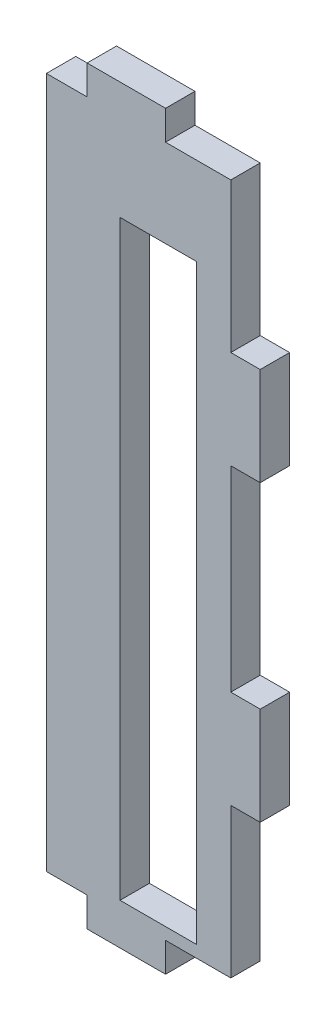
ISO-10303-21;
HEADER;
FILE_DESCRIPTION(('STEP AP214'),'2;1');
FILE_NAME('part.step','',(''),(''),'','','');
FILE_SCHEMA(('AUTOMOTIVE_DESIGN { 1 0 10303 214 1 1 1 1 }'));
ENDSEC;
DATA;
#1=APPLICATION_CONTEXT('core data for automotive mechanical design processes');
#2=APPLICATION_PROTOCOL_DEFINITION('international standard','automotive_design',2000,#1);
#3=PRODUCT_CONTEXT('',#1,'mechanical');
#4=PRODUCT('Part','Part','',(#3));
#5=PRODUCT_RELATED_PRODUCT_CATEGORY('part','',(#4));
#6=PRODUCT_DEFINITION_FORMATION('','',#4);
#7=PRODUCT_DEFINITION_CONTEXT('part definition',#1,'design');
#8=PRODUCT_DEFINITION('design','',#6,#7);
#9=PRODUCT_DEFINITION_SHAPE('','',#8);
#10=(LENGTH_UNIT() NAMED_UNIT(*) SI_UNIT(.MILLI.,.METRE.));
#11=(NAMED_UNIT(*) PLANE_ANGLE_UNIT() SI_UNIT($,.RADIAN.));
#12=(NAMED_UNIT(*) SI_UNIT($,.STERADIAN.) SOLID_ANGLE_UNIT());
#13=UNCERTAINTY_MEASURE_WITH_UNIT(LENGTH_MEASURE(1.E-05),#10,'distance_accuracy_value','');
#14=(GEOMETRIC_REPRESENTATION_CONTEXT(3) GLOBAL_UNCERTAINTY_ASSIGNED_CONTEXT((#13)) GLOBAL_UNIT_ASSIGNED_CONTEXT((#10,
#11,#12)) REPRESENTATION_CONTEXT('',''));
#15=CARTESIAN_POINT('',(0.,0.,0.));
#16=DIRECTION('',(0.,0.,1.));
#17=DIRECTION('',(1.,0.,0.));
#18=AXIS2_PLACEMENT_3D('',#15,#16,#17);
#19=CARTESIAN_POINT('',(0.,44.5,3.));
#20=DIRECTION('',(0.,-1.,0.));
#21=DIRECTION('',(0.,0.,-1.));
#22=AXIS2_PLACEMENT_3D('',#19,#20,#21);
#23=PLANE('',#22);
#24=DIRECTION('',(0.,0.,1.));
#25=VECTOR('',#24,1.);
#26=CARTESIAN_POINT('',(-14.6559207945465,44.4999999999999,0.));
#27=LINE('',#26,#25);
#28=CARTESIAN_POINT('',(-14.6559207945465,44.4999999999999,0.));
#29=VERTEX_POINT('',#28);
#30=CARTESIAN_POINT('',(-14.6559207945465,44.4999999999999,3.));
#31=VERTEX_POINT('',#30);
#32=EDGE_CURVE('E226',#29,#31,#27,.T.);
#33=ORIENTED_EDGE('',*,*,#32,.F.);
#34=DIRECTION('',(-1.,0.,0.));
#35=VECTOR('',#34,1.);
#36=CARTESIAN_POINT('',(0.,44.5,0.));
#37=LINE('',#36,#35);
#38=CARTESIAN_POINT('',(-18.811841589093,44.5,0.));
#39=VERTEX_POINT('',#38);
#40=EDGE_CURVE('E341',#29,#39,#37,.T.);
#41=ORIENTED_EDGE('',*,*,#40,.T.);
#42=DIRECTION('',(0.,0.,1.));
#43=VECTOR('',#42,1.);
#44=CARTESIAN_POINT('',(-18.811841589093,44.5,0.));
#45=LINE('',#44,#43);
#46=CARTESIAN_POINT('',(-18.811841589093,44.5,3.));
#47=VERTEX_POINT('',#46);
#48=EDGE_CURVE('E259',#39,#47,#45,.T.);
#49=ORIENTED_EDGE('',*,*,#48,.T.);
#50=DIRECTION('',(-1.,0.,0.));
#51=VECTOR('',#50,1.);
#52=CARTESIAN_POINT('',(0.,44.5,3.));
#53=LINE('',#52,#51);
#54=EDGE_CURVE('E313',#31,#47,#53,.T.);
#55=ORIENTED_EDGE('',*,*,#54,.F.);
#56=EDGE_LOOP('',(#33,#41,#49,#55));
#57=FACE_BOUND('',#56,.T.);
#58=ADVANCED_FACE('F33',(#57),#23,.F.);
#59=CARTESIAN_POINT('',(0.,-26.,3.));
#60=DIRECTION('',(0.,1.,0.));
#61=DIRECTION('',(0.,0.,1.));
#62=AXIS2_PLACEMENT_3D('',#59,#60,#61);
#63=PLANE('',#62);
#64=DIRECTION('',(0.,0.,1.));
#65=VECTOR('',#64,1.);
#66=CARTESIAN_POINT('',(-6.65592079454647,-25.9999999999998,0.));
#67=LINE('',#66,#65);
#68=CARTESIAN_POINT('',(-6.65592079454647,-25.9999999999998,0.));
#69=VERTEX_POINT('',#68);
#70=CARTESIAN_POINT('',(-6.65592079454647,-25.9999999999998,3.));
#71=VERTEX_POINT('',#70);
#72=EDGE_CURVE('E245',#69,#71,#67,.T.);
#73=ORIENTED_EDGE('',*,*,#72,.F.);
#74=DIRECTION('',(1.,0.,0.));
#75=VECTOR('',#74,1.);
#76=CARTESIAN_POINT('',(0.,-26.,0.));
#77=LINE('',#76,#75);
#78=CARTESIAN_POINT('',(0.,-26.,0.));
#79=VERTEX_POINT('',#78);
#80=EDGE_CURVE('E344',#69,#79,#77,.T.);
#81=ORIENTED_EDGE('',*,*,#80,.T.);
#82=DIRECTION('',(0.,0.,-1.));
#83=VECTOR('',#82,1.);
#84=CARTESIAN_POINT('',(0.,-26.,3.));
#85=LINE('',#84,#83);
#86=CARTESIAN_POINT('',(0.,-26.,3.));
#87=VERTEX_POINT('',#86);
#88=EDGE_CURVE('E351',#87,#79,#85,.T.);
#89=ORIENTED_EDGE('',*,*,#88,.F.);
#90=DIRECTION('',(1.,0.,0.));
#91=VECTOR('',#90,1.);
#92=CARTESIAN_POINT('',(-19.311841589093,-26.,3.));
#93=LINE('',#92,#91);
#94=EDGE_CURVE('E317',#71,#87,#93,.T.);
#95=ORIENTED_EDGE('',*,*,#94,.F.);
#96=EDGE_LOOP('',(#73,#81,#89,#95));
#97=FACE_BOUND('',#96,.T.);
#98=ADVANCED_FACE('F412',(#97),#63,.F.);
#99=CARTESIAN_POINT('',(0.,0.,3.));
#100=DIRECTION('',(0.,0.,1.));
#101=DIRECTION('',(1.,0.,0.));
#102=AXIS2_PLACEMENT_3D('',#99,#100,#101);
#103=PLANE('',#102);
#104=DIRECTION('',(0.,1.,0.));
#105=VECTOR('',#104,1.);
#106=CARTESIAN_POINT('',(-18.811841589093,-26.,3.));
#107=LINE('',#106,#105);
#108=CARTESIAN_POINT('',(-18.811841589093,-26.,3.));
#109=VERTEX_POINT('',#108);
#110=EDGE_CURVE('E247',#109,#47,#107,.T.);
#111=ORIENTED_EDGE('',*,*,#110,.F.);
#112=CARTESIAN_POINT('',(-14.6559207945465,-26.,3.));
#113=VERTEX_POINT('',#112);
#114=EDGE_CURVE('E318',#109,#113,#93,.T.);
#115=ORIENTED_EDGE('',*,*,#114,.T.);
#116=DIRECTION('',(0.,-1.,0.));
#117=VECTOR('',#116,1.);
#118=CARTESIAN_POINT('',(-14.6559207945465,-25.9999999999998,3.));
#119=LINE('',#118,#117);
#120=CARTESIAN_POINT('',(-14.6559207945465,-28.9999999999998,3.));
#121=VERTEX_POINT('',#120);
#122=EDGE_CURVE('E56',#113,#121,#119,.T.);
#123=ORIENTED_EDGE('',*,*,#122,.T.);
#124=DIRECTION('',(1.,0.,0.));
#125=VECTOR('',#124,1.);
#126=CARTESIAN_POINT('',(-6.65592079454647,-28.9999999999998,3.));
#127=LINE('',#126,#125);
#128=CARTESIAN_POINT('',(-6.65592079454647,-28.9999999999998,3.));
#129=VERTEX_POINT('',#128);
#130=EDGE_CURVE('E240',#121,#129,#127,.T.);
#131=ORIENTED_EDGE('',*,*,#130,.T.);
#132=DIRECTION('',(0.,1.,0.));
#133=VECTOR('',#132,1.);
#134=CARTESIAN_POINT('',(-6.65592079454647,-25.9999999999998,3.));
#135=LINE('',#134,#133);
#136=EDGE_CURVE('E233',#129,#71,#135,.T.);
#137=ORIENTED_EDGE('',*,*,#136,.T.);
#138=ORIENTED_EDGE('',*,*,#94,.T.);
#139=DIRECTION('',(0.,1.,0.));
#140=VECTOR('',#139,1.);
#141=CARTESIAN_POINT('',(0.,-24.,3.));
#142=LINE('',#141,#140);
#143=CARTESIAN_POINT('',(0.,-10.75,3.));
#144=VERTEX_POINT('',#143);
#145=EDGE_CURVE('E321',#87,#144,#142,.T.);
#146=ORIENTED_EDGE('',*,*,#145,.T.);
#147=DIRECTION('',(1.,0.,0.));
#148=VECTOR('',#147,1.);
#149=CARTESIAN_POINT('',(3.,-10.75,3.));
#150=LINE('',#149,#148);
#151=CARTESIAN_POINT('',(3.,-10.75,3.));
#152=VERTEX_POINT('',#151);
#153=EDGE_CURVE('E295',#144,#152,#150,.T.);
#154=ORIENTED_EDGE('',*,*,#153,.T.);
#155=DIRECTION('',(0.,1.,0.));
#156=VECTOR('',#155,1.);
#157=CARTESIAN_POINT('',(3.,-10.75,3.));
#158=LINE('',#157,#156);
#159=CARTESIAN_POINT('',(3.,-0.74999999999999,3.));
#160=VERTEX_POINT('',#159);
#161=EDGE_CURVE('E298',#152,#160,#158,.T.);
#162=ORIENTED_EDGE('',*,*,#161,.T.);
#163=DIRECTION('',(-1.,0.,0.));
#164=VECTOR('',#163,1.);
#165=CARTESIAN_POINT('',(3.,-0.74999999999999,3.));
#166=LINE('',#165,#164);
#167=CARTESIAN_POINT('',(0.,-0.749999999999987,3.));
#168=VERTEX_POINT('',#167);
#169=EDGE_CURVE('E301',#160,#168,#166,.T.);
#170=ORIENTED_EDGE('',*,*,#169,.T.);
#171=DIRECTION('',(0.,1.,0.));
#172=VECTOR('',#171,1.);
#173=CARTESIAN_POINT('',(0.,19.25,3.));
#174=LINE('',#173,#172);
#175=CARTESIAN_POINT('',(0.,19.25,3.));
#176=VERTEX_POINT('',#175);
#177=EDGE_CURVE('E303',#168,#176,#174,.T.);
#178=ORIENTED_EDGE('',*,*,#177,.T.);
#179=DIRECTION('',(1.,0.,0.));
#180=VECTOR('',#179,1.);
#181=CARTESIAN_POINT('',(3.,19.25,3.));
#182=LINE('',#181,#180);
#183=CARTESIAN_POINT('',(3.,19.25,3.));
#184=VERTEX_POINT('',#183);
#185=EDGE_CURVE('E305',#176,#184,#182,.T.);
#186=ORIENTED_EDGE('',*,*,#185,.T.);
#187=DIRECTION('',(0.,1.,0.));
#188=VECTOR('',#187,1.);
#189=CARTESIAN_POINT('',(3.,19.25,3.));
#190=LINE('',#189,#188);
#191=CARTESIAN_POINT('',(3.,29.25,3.));
#192=VERTEX_POINT('',#191);
#193=EDGE_CURVE('E307',#184,#192,#190,.T.);
#194=ORIENTED_EDGE('',*,*,#193,.T.);
#195=DIRECTION('',(-1.,0.,0.));
#196=VECTOR('',#195,1.);
#197=CARTESIAN_POINT('',(3.,29.25,3.));
#198=LINE('',#197,#196);
#199=CARTESIAN_POINT('',(0.,29.25,3.));
#200=VERTEX_POINT('',#199);
#201=EDGE_CURVE('E309',#192,#200,#198,.T.);
#202=ORIENTED_EDGE('',*,*,#201,.T.);
#203=DIRECTION('',(0.,1.,0.));
#204=VECTOR('',#203,1.);
#205=CARTESIAN_POINT('',(0.,42.5,3.));
#206=LINE('',#205,#204);
#207=CARTESIAN_POINT('',(0.,44.5,3.));
#208=VERTEX_POINT('',#207);
#209=EDGE_CURVE('E311',#200,#208,#206,.T.);
#210=ORIENTED_EDGE('',*,*,#209,.T.);
#211=CARTESIAN_POINT('',(-6.65592079454648,44.5,3.));
#212=VERTEX_POINT('',#211);
#213=EDGE_CURVE('E314',#208,#212,#53,.T.);
#214=ORIENTED_EDGE('',*,*,#213,.T.);
#215=DIRECTION('',(0.,1.,0.));
#216=VECTOR('',#215,1.);
#217=CARTESIAN_POINT('',(-6.65592079454648,44.4999999999999,3.));
#218=LINE('',#217,#216);
#219=CARTESIAN_POINT('',(-6.65592079454648,47.4999999999999,3.));
#220=VERTEX_POINT('',#219);
#221=EDGE_CURVE('E48',#212,#220,#218,.T.);
#222=ORIENTED_EDGE('',*,*,#221,.T.);
#223=DIRECTION('',(-1.,0.,0.));
#224=VECTOR('',#223,1.);
#225=CARTESIAN_POINT('',(-6.65592079454648,47.4999999999999,3.));
#226=LINE('',#225,#224);
#227=CARTESIAN_POINT('',(-14.6559207945465,47.4999999999999,3.));
#228=VERTEX_POINT('',#227);
#229=EDGE_CURVE('E199',#220,#228,#226,.T.);
#230=ORIENTED_EDGE('',*,*,#229,.T.);
#231=DIRECTION('',(0.,-1.,0.));
#232=VECTOR('',#231,1.);
#233=CARTESIAN_POINT('',(-14.6559207945465,44.4999999999999,3.));
#234=LINE('',#233,#232);
#235=EDGE_CURVE('E217',#228,#31,#234,.T.);
#236=ORIENTED_EDGE('',*,*,#235,.T.);
#237=ORIENTED_EDGE('',*,*,#54,.T.);
#238=EDGE_LOOP('',(#111,#115,#123,#131,#137,#138,#146,#154,#162,#170,#178,#186,#194,#202,#210,
#214,#222,#230,#236,#237));
#239=FACE_BOUND('',#238,.T.);
#240=DIRECTION('',(0.,1.,0.));
#241=VECTOR('',#240,1.);
#242=CARTESIAN_POINT('',(-3.5,-24.785,3.));
#243=LINE('',#242,#241);
#244=CARTESIAN_POINT('',(-3.5,-24.785,3.));
#245=VERTEX_POINT('',#244);
#246=CARTESIAN_POINT('',(-3.5,35.54,3.));
#247=VERTEX_POINT('',#246);
#248=EDGE_CURVE('E266',#245,#247,#243,.T.);
#249=ORIENTED_EDGE('',*,*,#248,.F.);
#250=DIRECTION('',(1.,0.,0.));
#251=VECTOR('',#250,1.);
#252=CARTESIAN_POINT('',(-3.5,-24.785,3.));
#253=LINE('',#252,#251);
#254=CARTESIAN_POINT('',(-11.3,-24.785,3.));
#255=VERTEX_POINT('',#254);
#256=EDGE_CURVE('E264',#255,#245,#253,.T.);
#257=ORIENTED_EDGE('',*,*,#256,.F.);
#258=DIRECTION('',(0.,-1.,0.));
#259=VECTOR('',#258,1.);
#260=CARTESIAN_POINT('',(-11.3,-24.785,3.));
#261=LINE('',#260,#259);
#262=CARTESIAN_POINT('',(-11.3,35.54,3.));
#263=VERTEX_POINT('',#262);
#264=EDGE_CURVE('E272',#263,#255,#261,.T.);
#265=ORIENTED_EDGE('',*,*,#264,.F.);
#266=DIRECTION('',(-1.,0.,0.));
#267=VECTOR('',#266,1.);
#268=CARTESIAN_POINT('',(-3.5,35.54,3.));
#269=LINE('',#268,#267);
#270=EDGE_CURVE('E269',#247,#263,#269,.T.);
#271=ORIENTED_EDGE('',*,*,#270,.F.);
#272=EDGE_LOOP('',(#249,#257,#265,#271));
#273=FACE_BOUND('',#272,.T.);
#274=ADVANCED_FACE('F394',(#239,#273),#103,.T.);
#275=CARTESIAN_POINT('',(0.,0.,0.));
#276=DIRECTION('',(0.,0.,1.));
#277=DIRECTION('',(1.,0.,0.));
#278=AXIS2_PLACEMENT_3D('',#275,#276,#277);
#279=PLANE('',#278);
#280=CARTESIAN_POINT('',(-18.811841589093,-26.,0.));
#281=VERTEX_POINT('',#280);
#282=CARTESIAN_POINT('',(-14.6559207945465,-25.9999999999998,0.));
#283=VERTEX_POINT('',#282);
#284=EDGE_CURVE('E345',#281,#283,#77,.T.);
#285=ORIENTED_EDGE('',*,*,#284,.F.);
#286=DIRECTION('',(0.,1.,0.));
#287=VECTOR('',#286,1.);
#288=CARTESIAN_POINT('',(-18.811841589093,-26.,0.));
#289=LINE('',#288,#287);
#290=EDGE_CURVE('E253',#281,#39,#289,.T.);
#291=ORIENTED_EDGE('',*,*,#290,.T.);
#292=ORIENTED_EDGE('',*,*,#40,.F.);
#293=DIRECTION('',(0.,-1.,0.));
#294=VECTOR('',#293,1.);
#295=CARTESIAN_POINT('',(-14.6559207945465,44.4999999999999,0.));
#296=LINE('',#295,#294);
#297=CARTESIAN_POINT('',(-14.6559207945465,47.4999999999999,0.));
#298=VERTEX_POINT('',#297);
#299=EDGE_CURVE('E202',#298,#29,#296,.T.);
#300=ORIENTED_EDGE('',*,*,#299,.F.);
#301=DIRECTION('',(-1.,0.,0.));
#302=VECTOR('',#301,1.);
#303=CARTESIAN_POINT('',(-6.65592079454648,47.4999999999999,0.));
#304=LINE('',#303,#302);
#305=CARTESIAN_POINT('',(-6.65592079454648,47.4999999999999,0.));
#306=VERTEX_POINT('',#305);
#307=EDGE_CURVE('E197',#306,#298,#304,.T.);
#308=ORIENTED_EDGE('',*,*,#307,.F.);
#309=DIRECTION('',(0.,1.,0.));
#310=VECTOR('',#309,1.);
#311=CARTESIAN_POINT('',(-6.65592079454648,44.4999999999999,0.));
#312=LINE('',#311,#310);
#313=CARTESIAN_POINT('',(-6.65592079454648,44.4999999999999,0.));
#314=VERTEX_POINT('',#313);
#315=EDGE_CURVE('E211',#314,#306,#312,.T.);
#316=ORIENTED_EDGE('',*,*,#315,.F.);
#317=CARTESIAN_POINT('',(0.,44.5,0.));
#318=VERTEX_POINT('',#317);
#319=EDGE_CURVE('E342',#318,#314,#37,.T.);
#320=ORIENTED_EDGE('',*,*,#319,.F.);
#321=DIRECTION('',(0.,1.,0.));
#322=VECTOR('',#321,1.);
#323=CARTESIAN_POINT('',(0.,44.5,0.));
#324=LINE('',#323,#322);
#325=CARTESIAN_POINT('',(0.,29.25,0.));
#326=VERTEX_POINT('',#325);
#327=EDGE_CURVE('E339',#326,#318,#324,.T.);
#328=ORIENTED_EDGE('',*,*,#327,.F.);
#329=DIRECTION('',(-1.,0.,0.));
#330=VECTOR('',#329,1.);
#331=CARTESIAN_POINT('',(3.,29.25,0.));
#332=LINE('',#331,#330);
#333=CARTESIAN_POINT('',(3.,29.25,0.));
#334=VERTEX_POINT('',#333);
#335=EDGE_CURVE('E336',#334,#326,#332,.T.);
#336=ORIENTED_EDGE('',*,*,#335,.F.);
#337=DIRECTION('',(0.,1.,0.));
#338=VECTOR('',#337,1.);
#339=CARTESIAN_POINT('',(3.,19.25,0.));
#340=LINE('',#339,#338);
#341=CARTESIAN_POINT('',(3.,19.25,0.));
#342=VERTEX_POINT('',#341);
#343=EDGE_CURVE('E334',#342,#334,#340,.T.);
#344=ORIENTED_EDGE('',*,*,#343,.F.);
#345=DIRECTION('',(1.,0.,0.));
#346=VECTOR('',#345,1.);
#347=CARTESIAN_POINT('',(3.,19.25,0.));
#348=LINE('',#347,#346);
#349=CARTESIAN_POINT('',(0.,19.25,0.));
#350=VERTEX_POINT('',#349);
#351=EDGE_CURVE('E332',#350,#342,#348,.T.);
#352=ORIENTED_EDGE('',*,*,#351,.F.);
#353=DIRECTION('',(0.,1.,0.));
#354=VECTOR('',#353,1.);
#355=CARTESIAN_POINT('',(0.,19.25,0.));
#356=LINE('',#355,#354);
#357=CARTESIAN_POINT('',(0.,-0.749999999999987,0.));
#358=VERTEX_POINT('',#357);
#359=EDGE_CURVE('E330',#358,#350,#356,.T.);
#360=ORIENTED_EDGE('',*,*,#359,.F.);
#361=DIRECTION('',(-1.,0.,0.));
#362=VECTOR('',#361,1.);
#363=CARTESIAN_POINT('',(3.,-0.74999999999999,0.));
#364=LINE('',#363,#362);
#365=CARTESIAN_POINT('',(3.,-0.74999999999999,0.));
#366=VERTEX_POINT('',#365);
#367=EDGE_CURVE('E328',#366,#358,#364,.T.);
#368=ORIENTED_EDGE('',*,*,#367,.F.);
#369=DIRECTION('',(0.,1.,0.));
#370=VECTOR('',#369,1.);
#371=CARTESIAN_POINT('',(3.,-10.75,0.));
#372=LINE('',#371,#370);
#373=CARTESIAN_POINT('',(3.,-10.75,0.));
#374=VERTEX_POINT('',#373);
#375=EDGE_CURVE('E326',#374,#366,#372,.T.);
#376=ORIENTED_EDGE('',*,*,#375,.F.);
#377=DIRECTION('',(1.,0.,0.));
#378=VECTOR('',#377,1.);
#379=CARTESIAN_POINT('',(3.,-10.75,0.));
#380=LINE('',#379,#378);
#381=CARTESIAN_POINT('',(0.,-10.75,0.));
#382=VERTEX_POINT('',#381);
#383=EDGE_CURVE('E294',#382,#374,#380,.T.);
#384=ORIENTED_EDGE('',*,*,#383,.F.);
#385=DIRECTION('',(0.,1.,0.));
#386=VECTOR('',#385,1.);
#387=CARTESIAN_POINT('',(0.,-10.75,0.));
#388=LINE('',#387,#386);
#389=EDGE_CURVE('E299',#79,#382,#388,.T.);
#390=ORIENTED_EDGE('',*,*,#389,.F.);
#391=ORIENTED_EDGE('',*,*,#80,.F.);
#392=DIRECTION('',(0.,1.,0.));
#393=VECTOR('',#392,1.);
#394=CARTESIAN_POINT('',(-6.65592079454647,-25.9999999999998,0.));
#395=LINE('',#394,#393);
#396=CARTESIAN_POINT('',(-6.65592079454647,-28.9999999999998,0.));
#397=VERTEX_POINT('',#396);
#398=EDGE_CURVE('E236',#397,#69,#395,.T.);
#399=ORIENTED_EDGE('',*,*,#398,.F.);
#400=DIRECTION('',(1.,0.,0.));
#401=VECTOR('',#400,1.);
#402=CARTESIAN_POINT('',(-6.65592079454647,-28.9999999999998,0.));
#403=LINE('',#402,#401);
#404=CARTESIAN_POINT('',(-14.6559207945465,-28.9999999999998,0.));
#405=VERTEX_POINT('',#404);
#406=EDGE_CURVE('E232',#405,#397,#403,.T.);
#407=ORIENTED_EDGE('',*,*,#406,.F.);
#408=DIRECTION('',(0.,-1.,0.));
#409=VECTOR('',#408,1.);
#410=CARTESIAN_POINT('',(-14.6559207945465,-25.9999999999998,0.));
#411=LINE('',#410,#409);
#412=EDGE_CURVE('E229',#283,#405,#411,.T.);
#413=ORIENTED_EDGE('',*,*,#412,.F.);
#414=EDGE_LOOP('',(#285,#291,#292,#300,#308,#316,#320,#328,#336,#344,#352,#360,#368,#376,#384,
#390,#391,#399,#407,#413));
#415=FACE_BOUND('',#414,.T.);
#416=DIRECTION('',(1.,0.,0.));
#417=VECTOR('',#416,1.);
#418=CARTESIAN_POINT('',(-3.5,-24.785,0.));
#419=LINE('',#418,#417);
#420=CARTESIAN_POINT('',(-11.3,-24.785,0.));
#421=VERTEX_POINT('',#420);
#422=CARTESIAN_POINT('',(-3.5,-24.785,0.));
#423=VERTEX_POINT('',#422);
#424=EDGE_CURVE('E262',#421,#423,#419,.T.);
#425=ORIENTED_EDGE('',*,*,#424,.T.);
#426=DIRECTION('',(0.,1.,0.));
#427=VECTOR('',#426,1.);
#428=CARTESIAN_POINT('',(-3.5,-24.785,0.));
#429=LINE('',#428,#427);
#430=CARTESIAN_POINT('',(-3.5,35.54,0.));
#431=VERTEX_POINT('',#430);
#432=EDGE_CURVE('E277',#423,#431,#429,.T.);
#433=ORIENTED_EDGE('',*,*,#432,.T.);
#434=DIRECTION('',(-1.,0.,0.));
#435=VECTOR('',#434,1.);
#436=CARTESIAN_POINT('',(-3.5,35.54,0.));
#437=LINE('',#436,#435);
#438=CARTESIAN_POINT('',(-11.3,35.54,0.));
#439=VERTEX_POINT('',#438);
#440=EDGE_CURVE('E280',#431,#439,#437,.T.);
#441=ORIENTED_EDGE('',*,*,#440,.T.);
#442=DIRECTION('',(0.,-1.,0.));
#443=VECTOR('',#442,1.);
#444=CARTESIAN_POINT('',(-11.3,-24.785,0.));
#445=LINE('',#444,#443);
#446=EDGE_CURVE('E267',#439,#421,#445,.T.);
#447=ORIENTED_EDGE('',*,*,#446,.T.);
#448=EDGE_LOOP('',(#425,#433,#441,#447));
#449=FACE_BOUND('',#448,.T.);
#450=ADVANCED_FACE('F208',(#415,#449),#279,.F.);
#451=CARTESIAN_POINT('',(3.,-10.75,3.));
#452=DIRECTION('',(0.,1.,0.));
#453=DIRECTION('',(0.,0.,1.));
#454=AXIS2_PLACEMENT_3D('',#451,#452,#453);
#455=PLANE('',#454);
#456=ORIENTED_EDGE('',*,*,#383,.T.);
#457=DIRECTION('',(0.,0.,-1.));
#458=VECTOR('',#457,1.);
#459=CARTESIAN_POINT('',(3.,-10.75,3.));
#460=LINE('',#459,#458);
#461=EDGE_CURVE('E11',#152,#374,#460,.T.);
#462=ORIENTED_EDGE('',*,*,#461,.F.);
#463=ORIENTED_EDGE('',*,*,#153,.F.);
#464=DIRECTION('',(0.,0.,-1.));
#465=VECTOR('',#464,1.);
#466=CARTESIAN_POINT('',(0.,-10.75,3.));
#467=LINE('',#466,#465);
#468=EDGE_CURVE('E323',#144,#382,#467,.T.);
#469=ORIENTED_EDGE('',*,*,#468,.T.);
#470=EDGE_LOOP('',(#456,#462,#463,#469));
#471=FACE_BOUND('',#470,.T.);
#472=ADVANCED_FACE('F35',(#471),#455,.F.);
#473=CARTESIAN_POINT('',(3.,-10.75,3.));
#474=DIRECTION('',(-1.,0.,0.));
#475=DIRECTION('',(0.,0.,1.));
#476=AXIS2_PLACEMENT_3D('',#473,#474,#475);
#477=PLANE('',#476);
#478=ORIENTED_EDGE('',*,*,#375,.T.);
#479=DIRECTION('',(0.,0.,-1.));
#480=VECTOR('',#479,1.);
#481=CARTESIAN_POINT('',(3.,-0.74999999999999,3.));
#482=LINE('',#481,#480);
#483=EDGE_CURVE('E41',#160,#366,#482,.T.);
#484=ORIENTED_EDGE('',*,*,#483,.F.);
#485=ORIENTED_EDGE('',*,*,#161,.F.);
#486=ORIENTED_EDGE('',*,*,#461,.T.);
#487=EDGE_LOOP('',(#478,#484,#485,#486));
#488=FACE_BOUND('',#487,.T.);
#489=ADVANCED_FACE('F399',(#488),#477,.F.);
#490=CARTESIAN_POINT('',(3.,-0.74999999999999,3.));
#491=DIRECTION('',(0.,-1.,0.));
#492=DIRECTION('',(1.,0.,0.));
#493=AXIS2_PLACEMENT_3D('',#490,#491,#492);
#494=PLANE('',#493);
#495=ORIENTED_EDGE('',*,*,#367,.T.);
#496=DIRECTION('',(0.,0.,-1.));
#497=VECTOR('',#496,1.);
#498=CARTESIAN_POINT('',(0.,-0.749999999999987,3.));
#499=LINE('',#498,#497);
#500=EDGE_CURVE('E369',#168,#358,#499,.T.);
#501=ORIENTED_EDGE('',*,*,#500,.F.);
#502=ORIENTED_EDGE('',*,*,#169,.F.);
#503=ORIENTED_EDGE('',*,*,#483,.T.);
#504=EDGE_LOOP('',(#495,#501,#502,#503));
#505=FACE_BOUND('',#504,.T.);
#506=ADVANCED_FACE('F376',(#505),#494,.F.);
#507=CARTESIAN_POINT('',(0.,19.25,3.));
#508=DIRECTION('',(-1.,0.,0.));
#509=DIRECTION('',(0.,0.,1.));
#510=AXIS2_PLACEMENT_3D('',#507,#508,#509);
#511=PLANE('',#510);
#512=ORIENTED_EDGE('',*,*,#359,.T.);
#513=DIRECTION('',(0.,0.,-1.));
#514=VECTOR('',#513,1.);
#515=CARTESIAN_POINT('',(0.,19.25,3.));
#516=LINE('',#515,#514);
#517=EDGE_CURVE('E366',#176,#350,#516,.T.);
#518=ORIENTED_EDGE('',*,*,#517,.F.);
#519=ORIENTED_EDGE('',*,*,#177,.F.);
#520=ORIENTED_EDGE('',*,*,#500,.T.);
#521=EDGE_LOOP('',(#512,#518,#519,#520));
#522=FACE_BOUND('',#521,.T.);
#523=ADVANCED_FACE('F385',(#522),#511,.F.);
#524=CARTESIAN_POINT('',(3.,19.25,3.));
#525=DIRECTION('',(0.,1.,0.));
#526=DIRECTION('',(0.,0.,1.));
#527=AXIS2_PLACEMENT_3D('',#524,#525,#526);
#528=PLANE('',#527);
#529=ORIENTED_EDGE('',*,*,#351,.T.);
#530=DIRECTION('',(0.,0.,-1.));
#531=VECTOR('',#530,1.);
#532=CARTESIAN_POINT('',(3.,19.25,3.));
#533=LINE('',#532,#531);
#534=EDGE_CURVE('E363',#184,#342,#533,.T.);
#535=ORIENTED_EDGE('',*,*,#534,.F.);
#536=ORIENTED_EDGE('',*,*,#185,.F.);
#537=ORIENTED_EDGE('',*,*,#517,.T.);
#538=EDGE_LOOP('',(#529,#535,#536,#537));
#539=FACE_BOUND('',#538,.T.);
#540=ADVANCED_FACE('F389',(#539),#528,.F.);
#541=CARTESIAN_POINT('',(3.,19.25,3.));
#542=DIRECTION('',(-1.,0.,0.));
#543=DIRECTION('',(0.,0.,1.));
#544=AXIS2_PLACEMENT_3D('',#541,#542,#543);
#545=PLANE('',#544);
#546=ORIENTED_EDGE('',*,*,#343,.T.);
#547=DIRECTION('',(0.,0.,-1.));
#548=VECTOR('',#547,1.);
#549=CARTESIAN_POINT('',(3.,29.25,3.));
#550=LINE('',#549,#548);
#551=EDGE_CURVE('E360',#192,#334,#550,.T.);
#552=ORIENTED_EDGE('',*,*,#551,.F.);
#553=ORIENTED_EDGE('',*,*,#193,.F.);
#554=ORIENTED_EDGE('',*,*,#534,.T.);
#555=EDGE_LOOP('',(#546,#552,#553,#554));
#556=FACE_BOUND('',#555,.T.);
#557=ADVANCED_FACE('F454',(#556),#545,.F.);
#558=CARTESIAN_POINT('',(3.,29.25,3.));
#559=DIRECTION('',(0.,-1.,0.));
#560=DIRECTION('',(0.,0.,-1.));
#561=AXIS2_PLACEMENT_3D('',#558,#559,#560);
#562=PLANE('',#561);
#563=ORIENTED_EDGE('',*,*,#335,.T.);
#564=DIRECTION('',(0.,0.,-1.));
#565=VECTOR('',#564,1.);
#566=CARTESIAN_POINT('',(0.,29.25,3.));
#567=LINE('',#566,#565);
#568=EDGE_CURVE('E357',#200,#326,#567,.T.);
#569=ORIENTED_EDGE('',*,*,#568,.F.);
#570=ORIENTED_EDGE('',*,*,#201,.F.);
#571=ORIENTED_EDGE('',*,*,#551,.T.);
#572=EDGE_LOOP('',(#563,#569,#570,#571));
#573=FACE_BOUND('',#572,.T.);
#574=ADVANCED_FACE('F444',(#573),#562,.F.);
#575=CARTESIAN_POINT('',(0.,44.5,3.));
#576=DIRECTION('',(-1.,0.,0.));
#577=DIRECTION('',(0.,0.,1.));
#578=AXIS2_PLACEMENT_3D('',#575,#576,#577);
#579=PLANE('',#578);
#580=ORIENTED_EDGE('',*,*,#327,.T.);
#581=DIRECTION('',(0.,0.,-1.));
#582=VECTOR('',#581,1.);
#583=CARTESIAN_POINT('',(0.,44.5,3.));
#584=LINE('',#583,#582);
#585=EDGE_CURVE('E354',#208,#318,#584,.T.);
#586=ORIENTED_EDGE('',*,*,#585,.F.);
#587=ORIENTED_EDGE('',*,*,#209,.F.);
#588=ORIENTED_EDGE('',*,*,#568,.T.);
#589=EDGE_LOOP('',(#580,#586,#587,#588));
#590=FACE_BOUND('',#589,.T.);
#591=ADVANCED_FACE('F446',(#590),#579,.F.);
#592=ORIENTED_EDGE('',*,*,#319,.T.);
#593=DIRECTION('',(0.,0.,1.));
#594=VECTOR('',#593,1.);
#595=CARTESIAN_POINT('',(-6.65592079454648,44.4999999999999,0.));
#596=LINE('',#595,#594);
#597=EDGE_CURVE('E216',#314,#212,#596,.T.);
#598=ORIENTED_EDGE('',*,*,#597,.T.);
#599=ORIENTED_EDGE('',*,*,#213,.F.);
#600=ORIENTED_EDGE('',*,*,#585,.T.);
#601=EDGE_LOOP('',(#592,#598,#599,#600));
#602=FACE_BOUND('',#601,.T.);
#603=ADVANCED_FACE('F439',(#602),#23,.F.);
#604=ORIENTED_EDGE('',*,*,#284,.T.);
#605=DIRECTION('',(0.,0.,1.));
#606=VECTOR('',#605,1.);
#607=CARTESIAN_POINT('',(-14.6559207945465,-25.9999999999998,0.));
#608=LINE('',#607,#606);
#609=EDGE_CURVE('E238',#283,#113,#608,.T.);
#610=ORIENTED_EDGE('',*,*,#609,.T.);
#611=ORIENTED_EDGE('',*,*,#114,.F.);
#612=DIRECTION('',(0.,0.,1.));
#613=VECTOR('',#612,1.);
#614=CARTESIAN_POINT('',(-18.811841589093,-26.,0.));
#615=LINE('',#614,#613);
#616=EDGE_CURVE('E256',#281,#109,#615,.T.);
#617=ORIENTED_EDGE('',*,*,#616,.F.);
#618=EDGE_LOOP('',(#604,#610,#611,#617));
#619=FACE_BOUND('',#618,.T.);
#620=ADVANCED_FACE('F424',(#619),#63,.F.);
#621=CARTESIAN_POINT('',(0.,-10.75,3.));
#622=DIRECTION('',(-1.,0.,0.));
#623=DIRECTION('',(0.,0.,1.));
#624=AXIS2_PLACEMENT_3D('',#621,#622,#623);
#625=PLANE('',#624);
#626=ORIENTED_EDGE('',*,*,#389,.T.);
#627=ORIENTED_EDGE('',*,*,#468,.F.);
#628=ORIENTED_EDGE('',*,*,#145,.F.);
#629=ORIENTED_EDGE('',*,*,#88,.T.);
#630=EDGE_LOOP('',(#626,#627,#628,#629));
#631=FACE_BOUND('',#630,.T.);
#632=ADVANCED_FACE('F408',(#631),#625,.F.);
#633=CARTESIAN_POINT('',(-3.5,-24.785,3.));
#634=DIRECTION('',(0.,1.,0.));
#635=DIRECTION('',(0.,0.,1.));
#636=AXIS2_PLACEMENT_3D('',#633,#634,#635);
#637=PLANE('',#636);
#638=ORIENTED_EDGE('',*,*,#424,.F.);
#639=DIRECTION('',(0.,0.,-1.));
#640=VECTOR('',#639,1.);
#641=CARTESIAN_POINT('',(-11.3,-24.785,3.));
#642=LINE('',#641,#640);
#643=EDGE_CURVE('E274',#255,#421,#642,.T.);
#644=ORIENTED_EDGE('',*,*,#643,.F.);
#645=ORIENTED_EDGE('',*,*,#256,.T.);
#646=DIRECTION('',(0.,0.,-1.));
#647=VECTOR('',#646,1.);
#648=CARTESIAN_POINT('',(-3.5,-24.785,3.));
#649=LINE('',#648,#647);
#650=EDGE_CURVE('E291',#245,#423,#649,.T.);
#651=ORIENTED_EDGE('',*,*,#650,.T.);
#652=EDGE_LOOP('',(#638,#644,#645,#651));
#653=FACE_BOUND('',#652,.T.);
#654=ADVANCED_FACE('F465',(#653),#637,.T.);
#655=CARTESIAN_POINT('',(-3.5,-24.785,3.));
#656=DIRECTION('',(-1.,0.,0.));
#657=DIRECTION('',(0.,0.,1.));
#658=AXIS2_PLACEMENT_3D('',#655,#656,#657);
#659=PLANE('',#658);
#660=ORIENTED_EDGE('',*,*,#432,.F.);
#661=ORIENTED_EDGE('',*,*,#650,.F.);
#662=ORIENTED_EDGE('',*,*,#248,.T.);
#663=DIRECTION('',(0.,0.,-1.));
#664=VECTOR('',#663,1.);
#665=CARTESIAN_POINT('',(-3.5,35.54,3.));
#666=LINE('',#665,#664);
#667=EDGE_CURVE('E289',#247,#431,#666,.T.);
#668=ORIENTED_EDGE('',*,*,#667,.T.);
#669=EDGE_LOOP('',(#660,#661,#662,#668));
#670=FACE_BOUND('',#669,.T.);
#671=ADVANCED_FACE('F472',(#670),#659,.T.);
#672=CARTESIAN_POINT('',(-3.5,35.54,3.));
#673=DIRECTION('',(0.,-1.,0.));
#674=DIRECTION('',(0.,0.,-1.));
#675=AXIS2_PLACEMENT_3D('',#672,#673,#674);
#676=PLANE('',#675);
#677=ORIENTED_EDGE('',*,*,#440,.F.);
#678=ORIENTED_EDGE('',*,*,#667,.F.);
#679=ORIENTED_EDGE('',*,*,#270,.T.);
#680=DIRECTION('',(0.,0.,-1.));
#681=VECTOR('',#680,1.);
#682=CARTESIAN_POINT('',(-11.3,35.54,3.));
#683=LINE('',#682,#681);
#684=EDGE_CURVE('E287',#263,#439,#683,.T.);
#685=ORIENTED_EDGE('',*,*,#684,.T.);
#686=EDGE_LOOP('',(#677,#678,#679,#685));
#687=FACE_BOUND('',#686,.T.);
#688=ADVANCED_FACE('F476',(#687),#676,.T.);
#689=CARTESIAN_POINT('',(-11.3,-24.785,3.));
#690=DIRECTION('',(1.,0.,0.));
#691=DIRECTION('',(0.,0.,-1.));
#692=AXIS2_PLACEMENT_3D('',#689,#690,#691);
#693=PLANE('',#692);
#694=ORIENTED_EDGE('',*,*,#446,.F.);
#695=ORIENTED_EDGE('',*,*,#684,.F.);
#696=ORIENTED_EDGE('',*,*,#264,.T.);
#697=ORIENTED_EDGE('',*,*,#643,.T.);
#698=EDGE_LOOP('',(#694,#695,#696,#697));
#699=FACE_BOUND('',#698,.T.);
#700=ADVANCED_FACE('F480',(#699),#693,.T.);
#701=CARTESIAN_POINT('',(-18.811841589093,-26.,0.));
#702=DIRECTION('',(1.,0.,0.));
#703=DIRECTION('',(0.,0.,-1.));
#704=AXIS2_PLACEMENT_3D('',#701,#702,#703);
#705=PLANE('',#704);
#706=ORIENTED_EDGE('',*,*,#110,.T.);
#707=ORIENTED_EDGE('',*,*,#48,.F.);
#708=ORIENTED_EDGE('',*,*,#290,.F.);
#709=ORIENTED_EDGE('',*,*,#616,.T.);
#710=EDGE_LOOP('',(#706,#707,#708,#709));
#711=FACE_BOUND('',#710,.T.);
#712=ADVANCED_FACE('F429',(#711),#705,.F.);
#713=CARTESIAN_POINT('',(-6.65592079454647,-25.9999999999998,0.));
#714=DIRECTION('',(1.,0.,0.));
#715=DIRECTION('',(0.,0.,-1.));
#716=AXIS2_PLACEMENT_3D('',#713,#714,#715);
#717=PLANE('',#716);
#718=ORIENTED_EDGE('',*,*,#136,.F.);
#719=DIRECTION('',(0.,0.,1.));
#720=VECTOR('',#719,1.);
#721=CARTESIAN_POINT('',(-6.65592079454647,-28.9999999999998,0.));
#722=LINE('',#721,#720);
#723=EDGE_CURVE('E248',#397,#129,#722,.T.);
#724=ORIENTED_EDGE('',*,*,#723,.F.);
#725=ORIENTED_EDGE('',*,*,#398,.T.);
#726=ORIENTED_EDGE('',*,*,#72,.T.);
#727=EDGE_LOOP('',(#718,#724,#725,#726));
#728=FACE_BOUND('',#727,.T.);
#729=ADVANCED_FACE('F415',(#728),#717,.T.);
#730=CARTESIAN_POINT('',(-6.65592079454647,-28.9999999999998,0.));
#731=DIRECTION('',(0.,-1.,0.));
#732=DIRECTION('',(0.,0.,-1.));
#733=AXIS2_PLACEMENT_3D('',#730,#731,#732);
#734=PLANE('',#733);
#735=ORIENTED_EDGE('',*,*,#130,.F.);
#736=DIRECTION('',(0.,0.,1.));
#737=VECTOR('',#736,1.);
#738=CARTESIAN_POINT('',(-14.6559207945465,-28.9999999999998,0.));
#739=LINE('',#738,#737);
#740=EDGE_CURVE('E250',#405,#121,#739,.T.);
#741=ORIENTED_EDGE('',*,*,#740,.F.);
#742=ORIENTED_EDGE('',*,*,#406,.T.);
#743=ORIENTED_EDGE('',*,*,#723,.T.);
#744=EDGE_LOOP('',(#735,#741,#742,#743));
#745=FACE_BOUND('',#744,.T.);
#746=ADVANCED_FACE('F418',(#745),#734,.T.);
#747=CARTESIAN_POINT('',(-14.6559207945465,-25.9999999999998,0.));
#748=DIRECTION('',(-1.,0.,0.));
#749=DIRECTION('',(0.,0.,1.));
#750=AXIS2_PLACEMENT_3D('',#747,#748,#749);
#751=PLANE('',#750);
#752=ORIENTED_EDGE('',*,*,#122,.F.);
#753=ORIENTED_EDGE('',*,*,#609,.F.);
#754=ORIENTED_EDGE('',*,*,#412,.T.);
#755=ORIENTED_EDGE('',*,*,#740,.T.);
#756=EDGE_LOOP('',(#752,#753,#754,#755));
#757=FACE_BOUND('',#756,.T.);
#758=ADVANCED_FACE('F421',(#757),#751,.T.);
#759=CARTESIAN_POINT('',(-6.65592079454648,44.4999999999999,0.));
#760=DIRECTION('',(1.,0.,0.));
#761=DIRECTION('',(0.,1.,0.));
#762=AXIS2_PLACEMENT_3D('',#759,#760,#761);
#763=PLANE('',#762);
#764=ORIENTED_EDGE('',*,*,#221,.F.);
#765=ORIENTED_EDGE('',*,*,#597,.F.);
#766=ORIENTED_EDGE('',*,*,#315,.T.);
#767=DIRECTION('',(0.,0.,1.));
#768=VECTOR('',#767,1.);
#769=CARTESIAN_POINT('',(-6.65592079454648,47.4999999999999,0.));
#770=LINE('',#769,#768);
#771=EDGE_CURVE('E194',#306,#220,#770,.T.);
#772=ORIENTED_EDGE('',*,*,#771,.T.);
#773=EDGE_LOOP('',(#764,#765,#766,#772));
#774=FACE_BOUND('',#773,.T.);
#775=ADVANCED_FACE('F215',(#774),#763,.T.);
#776=CARTESIAN_POINT('',(-14.6559207945465,44.4999999999999,0.));
#777=DIRECTION('',(-1.,0.,0.));
#778=DIRECTION('',(0.,0.,1.));
#779=AXIS2_PLACEMENT_3D('',#776,#777,#778);
#780=PLANE('',#779);
#781=ORIENTED_EDGE('',*,*,#235,.F.);
#782=DIRECTION('',(0.,0.,1.));
#783=VECTOR('',#782,1.);
#784=CARTESIAN_POINT('',(-14.6559207945465,47.4999999999999,0.));
#785=LINE('',#784,#783);
#786=EDGE_CURVE('E201',#298,#228,#785,.T.);
#787=ORIENTED_EDGE('',*,*,#786,.F.);
#788=ORIENTED_EDGE('',*,*,#299,.T.);
#789=ORIENTED_EDGE('',*,*,#32,.T.);
#790=EDGE_LOOP('',(#781,#787,#788,#789));
#791=FACE_BOUND('',#790,.T.);
#792=ADVANCED_FACE('F434',(#791),#780,.T.);
#793=CARTESIAN_POINT('',(-6.65592079454648,47.4999999999999,0.));
#794=DIRECTION('',(0.,1.,0.));
#795=DIRECTION('',(0.,0.,1.));
#796=AXIS2_PLACEMENT_3D('',#793,#794,#795);
#797=PLANE('',#796);
#798=ORIENTED_EDGE('',*,*,#229,.F.);
#799=ORIENTED_EDGE('',*,*,#771,.F.);
#800=ORIENTED_EDGE('',*,*,#307,.T.);
#801=ORIENTED_EDGE('',*,*,#786,.T.);
#802=EDGE_LOOP('',(#798,#799,#800,#801));
#803=FACE_BOUND('',#802,.T.);
#804=ADVANCED_FACE('F196',(#803),#797,.T.);
#805=CLOSED_SHELL('',(#58,#98,#274,#450,#472,#489,#506,#523,#540,#557,#574,#591,#603,#620,#632,
#654,#671,#688,#700,#712,#729,#746,#758,#775,#792,#804));
#806=MANIFOLD_SOLID_BREP('B2',#805);
#807=ADVANCED_BREP_SHAPE_REPRESENTATION('',(#18,#806),#14);
#808=SHAPE_DEFINITION_REPRESENTATION(#9,#807);
ENDSEC;
END-ISO-10303-21;
